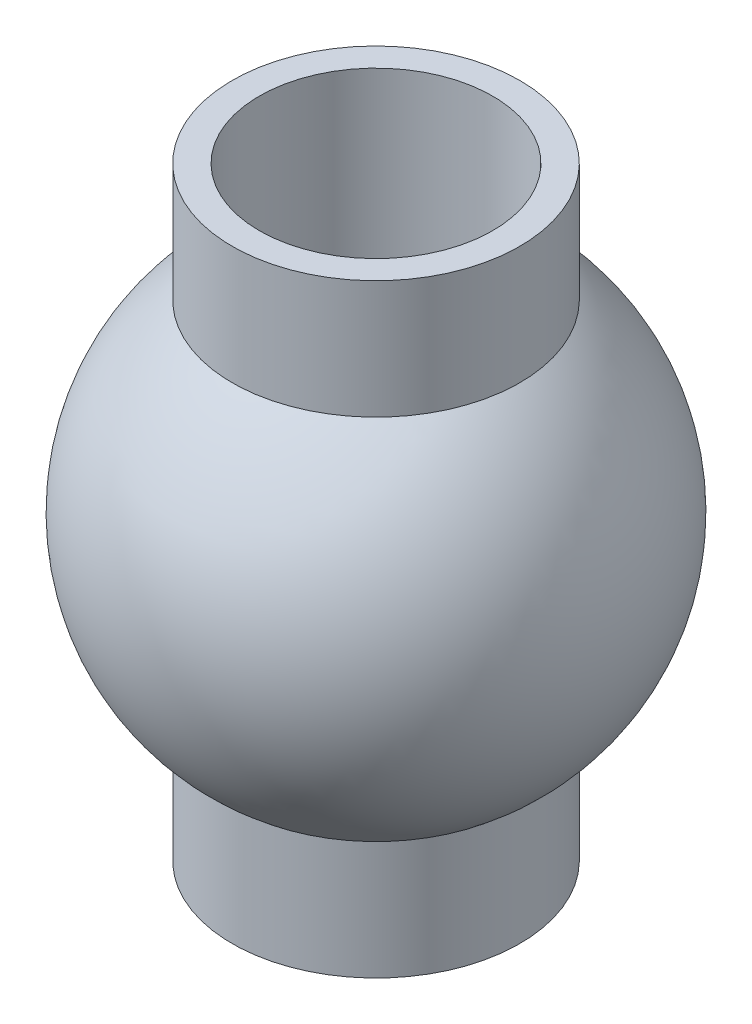
ISO-10303-21;
HEADER;
FILE_DESCRIPTION(('STEP AP214'),'2;1');
FILE_NAME('part.step','',(''),(''),'','','');
FILE_SCHEMA(('AUTOMOTIVE_DESIGN { 1 0 10303 214 1 1 1 1 }'));
ENDSEC;
DATA;
#1=APPLICATION_CONTEXT('core data for automotive mechanical design processes');
#2=APPLICATION_PROTOCOL_DEFINITION('international standard','automotive_design',2000,#1);
#3=PRODUCT_CONTEXT('',#1,'mechanical');
#4=PRODUCT('Part','Part','',(#3));
#5=PRODUCT_RELATED_PRODUCT_CATEGORY('part','',(#4));
#6=PRODUCT_DEFINITION_FORMATION('','',#4);
#7=PRODUCT_DEFINITION_CONTEXT('part definition',#1,'design');
#8=PRODUCT_DEFINITION('design','',#6,#7);
#9=PRODUCT_DEFINITION_SHAPE('','',#8);
#10=(LENGTH_UNIT() NAMED_UNIT(*) SI_UNIT(.MILLI.,.METRE.));
#11=(NAMED_UNIT(*) PLANE_ANGLE_UNIT() SI_UNIT($,.RADIAN.));
#12=(NAMED_UNIT(*) SI_UNIT($,.STERADIAN.) SOLID_ANGLE_UNIT());
#13=UNCERTAINTY_MEASURE_WITH_UNIT(LENGTH_MEASURE(1.E-05),#10,'distance_accuracy_value','');
#14=(GEOMETRIC_REPRESENTATION_CONTEXT(3) GLOBAL_UNCERTAINTY_ASSIGNED_CONTEXT((#13)) GLOBAL_UNIT_ASSIGNED_CONTEXT((#10,
#11,#12)) REPRESENTATION_CONTEXT('',''));
#15=CARTESIAN_POINT('',(0.,0.,0.));
#16=DIRECTION('',(0.,0.,1.));
#17=DIRECTION('',(1.,0.,0.));
#18=AXIS2_PLACEMENT_3D('',#15,#16,#17);
#19=CARTESIAN_POINT('',(2.23689332454051,0.,0.));
#20=DIRECTION('',(0.,-1.,0.));
#21=DIRECTION('',(0.,0.,-1.));
#22=AXIS2_PLACEMENT_3D('',#19,#20,#21);
#23=PLANE('',#22);
#24=CARTESIAN_POINT('',(0.,0.,0.));
#25=DIRECTION('',(0.,1.,0.));
#26=DIRECTION('',(0.,0.,1.));
#27=AXIS2_PLACEMENT_3D('',#24,#25,#26);
#28=CIRCLE('',#27,2.5);
#29=CARTESIAN_POINT('',(0.,0.,2.5));
#30=VERTEX_POINT('',#29);
#31=EDGE_CURVE('E56',#30,#30,#28,.T.);
#32=ORIENTED_EDGE('',*,*,#31,.T.);
#33=EDGE_LOOP('',(#32));
#34=FACE_BOUND('',#33,.T.);
#35=CARTESIAN_POINT('',(0.,0.,0.));
#36=DIRECTION('',(0.,-1.,0.));
#37=DIRECTION('',(0.,0.,-1.));
#38=AXIS2_PLACEMENT_3D('',#35,#36,#37);
#39=CIRCLE('',#38,3.08057016372045);
#40=CARTESIAN_POINT('',(0.,0.,-3.08057016372045));
#41=VERTEX_POINT('',#40);
#42=EDGE_CURVE('E10',#41,#41,#39,.T.);
#43=ORIENTED_EDGE('',*,*,#42,.T.);
#44=EDGE_LOOP('',(#43));
#45=FACE_BOUND('',#44,.T.);
#46=ADVANCED_FACE('F37',(#34,#45),#23,.T.);
#47=CARTESIAN_POINT('',(0.,0.,0.));
#48=DIRECTION('',(0.,-1.,0.));
#49=DIRECTION('',(0.,0.,-1.));
#50=AXIS2_PLACEMENT_3D('',#47,#48,#49);
#51=CYLINDRICAL_SURFACE('',#50,3.08057016372045);
#52=CARTESIAN_POINT('',(0.,2.53205016185087,0.));
#53=DIRECTION('',(0.,-1.,0.));
#54=DIRECTION('',(0.,0.,-1.));
#55=AXIS2_PLACEMENT_3D('',#52,#53,#54);
#56=CIRCLE('',#55,3.08057016372045);
#57=CARTESIAN_POINT('',(0.,2.53205016185087,-3.08057016372045));
#58=VERTEX_POINT('',#57);
#59=EDGE_CURVE('E43',#58,#58,#56,.T.);
#60=ORIENTED_EDGE('',*,*,#59,.T.);
#61=EDGE_LOOP('',(#60));
#62=FACE_BOUND('',#61,.T.);
#63=ORIENTED_EDGE('',*,*,#42,.F.);
#64=EDGE_LOOP('',(#63));
#65=FACE_BOUND('',#64,.T.);
#66=ADVANCED_FACE('F85',(#62,#65),#51,.T.);
#67=CARTESIAN_POINT('',(0.,6.470335,0.));
#68=DIRECTION('',(0.,-1.,0.));
#69=DIRECTION('',(1.,0.,0.));
#70=AXIS2_PLACEMENT_3D('',#67,#68,#69);
#71=SPHERICAL_SURFACE('',#70,5.);
#72=CARTESIAN_POINT('',(0.,10.4086198381491,0.));
#73=DIRECTION('',(0.,-1.,0.));
#74=DIRECTION('',(0.,0.,-1.));
#75=AXIS2_PLACEMENT_3D('',#72,#73,#74);
#76=CIRCLE('',#75,3.08057016372045);
#77=CARTESIAN_POINT('',(0.,10.4086198381491,-3.08057016372045));
#78=VERTEX_POINT('',#77);
#79=EDGE_CURVE('E47',#78,#78,#76,.T.);
#80=ORIENTED_EDGE('',*,*,#79,.T.);
#81=EDGE_LOOP('',(#80));
#82=FACE_BOUND('',#81,.T.);
#83=ORIENTED_EDGE('',*,*,#59,.F.);
#84=EDGE_LOOP('',(#83));
#85=FACE_BOUND('',#84,.T.);
#86=ADVANCED_FACE('F79',(#82,#85),#71,.T.);
#87=CARTESIAN_POINT('',(0.,0.,0.));
#88=DIRECTION('',(0.,-1.,0.));
#89=DIRECTION('',(0.,0.,-1.));
#90=AXIS2_PLACEMENT_3D('',#87,#88,#89);
#91=CYLINDRICAL_SURFACE('',#90,3.08057016372045);
#92=CARTESIAN_POINT('',(0.,12.94067,0.));
#93=DIRECTION('',(0.,-1.,0.));
#94=DIRECTION('',(0.,0.,-1.));
#95=AXIS2_PLACEMENT_3D('',#92,#93,#94);
#96=CIRCLE('',#95,3.08057016372045);
#97=CARTESIAN_POINT('',(0.,12.94067,-3.08057016372045));
#98=VERTEX_POINT('',#97);
#99=EDGE_CURVE('E51',#98,#98,#96,.T.);
#100=ORIENTED_EDGE('',*,*,#99,.T.);
#101=EDGE_LOOP('',(#100));
#102=FACE_BOUND('',#101,.T.);
#103=ORIENTED_EDGE('',*,*,#79,.F.);
#104=EDGE_LOOP('',(#103));
#105=FACE_BOUND('',#104,.T.);
#106=ADVANCED_FACE('F73',(#102,#105),#91,.T.);
#107=CARTESIAN_POINT('',(0.,12.94067,0.));
#108=DIRECTION('',(0.,1.,0.));
#109=DIRECTION('',(0.,0.,1.));
#110=AXIS2_PLACEMENT_3D('',#107,#108,#109);
#111=PLANE('',#110);
#112=CARTESIAN_POINT('',(0.,12.94067,0.));
#113=DIRECTION('',(0.,1.,0.));
#114=DIRECTION('',(0.,0.,1.));
#115=AXIS2_PLACEMENT_3D('',#112,#113,#114);
#116=CIRCLE('',#115,2.5);
#117=CARTESIAN_POINT('',(0.,12.94067,2.5));
#118=VERTEX_POINT('',#117);
#119=EDGE_CURVE('E57',#118,#118,#116,.T.);
#120=ORIENTED_EDGE('',*,*,#119,.F.);
#121=EDGE_LOOP('',(#120));
#122=FACE_BOUND('',#121,.T.);
#123=ORIENTED_EDGE('',*,*,#99,.F.);
#124=EDGE_LOOP('',(#123));
#125=FACE_BOUND('',#124,.T.);
#126=ADVANCED_FACE('F67',(#122,#125),#111,.T.);
#127=CARTESIAN_POINT('',(0.,0.,0.));
#128=DIRECTION('',(0.,1.,0.));
#129=DIRECTION('',(0.,0.,1.));
#130=AXIS2_PLACEMENT_3D('',#127,#128,#129);
#131=CYLINDRICAL_SURFACE('',#130,2.5);
#132=ORIENTED_EDGE('',*,*,#31,.F.);
#133=EDGE_LOOP('',(#132));
#134=FACE_BOUND('',#133,.T.);
#135=ORIENTED_EDGE('',*,*,#119,.T.);
#136=EDGE_LOOP('',(#135));
#137=FACE_BOUND('',#136,.T.);
#138=ADVANCED_FACE('F64',(#134,#137),#131,.F.);
#139=CLOSED_SHELL('',(#46,#66,#86,#106,#126,#138));
#140=MANIFOLD_SOLID_BREP('B2',#139);
#141=ADVANCED_BREP_SHAPE_REPRESENTATION('',(#18,#140),#14);
#142=SHAPE_DEFINITION_REPRESENTATION(#9,#141);
ENDSEC;
END-ISO-10303-21;
